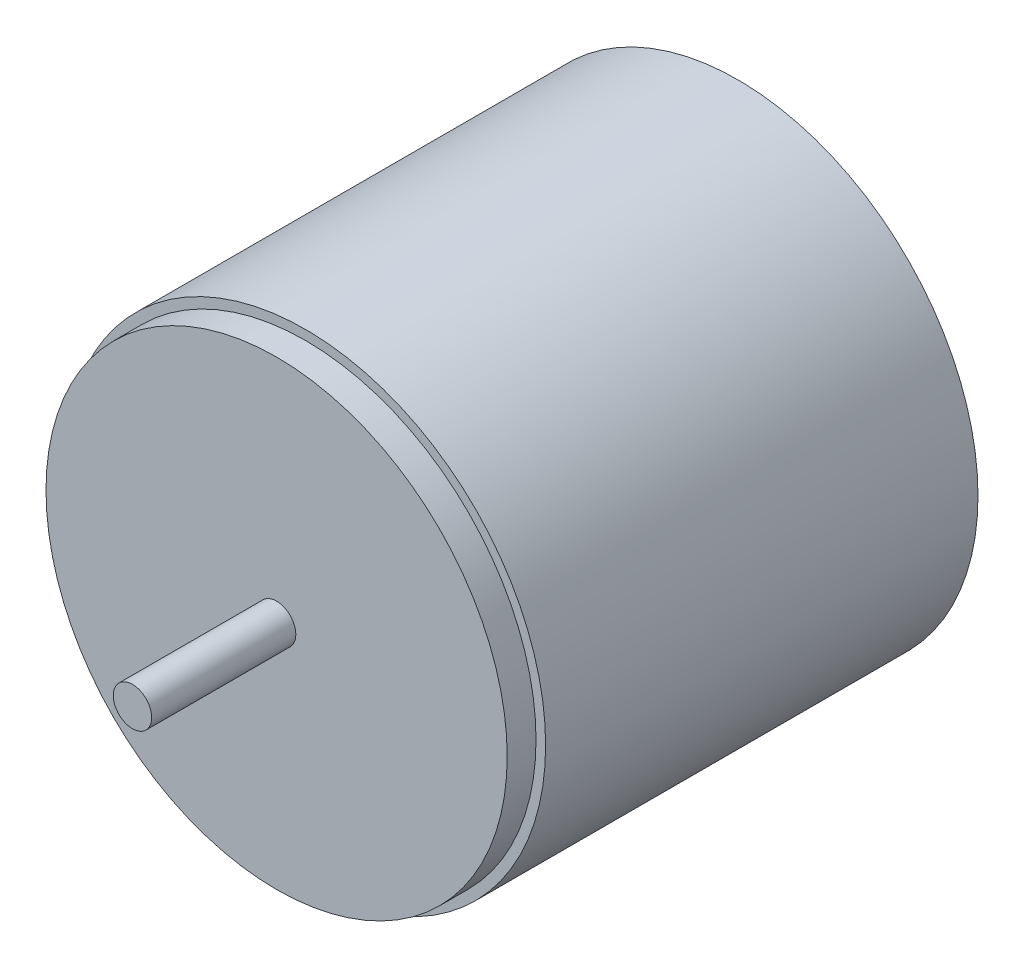
ISO-10303-21;
HEADER;
FILE_DESCRIPTION(('STEP AP214'),'2;1');
FILE_NAME('part.step','',(''),(''),'','','');
FILE_SCHEMA(('AUTOMOTIVE_DESIGN { 1 0 10303 214 1 1 1 1 }'));
ENDSEC;
DATA;
#1=APPLICATION_CONTEXT('core data for automotive mechanical design processes');
#2=APPLICATION_PROTOCOL_DEFINITION('international standard','automotive_design',2000,#1);
#3=PRODUCT_CONTEXT('',#1,'mechanical');
#4=PRODUCT('Part','Part','',(#3));
#5=PRODUCT_RELATED_PRODUCT_CATEGORY('part','',(#4));
#6=PRODUCT_DEFINITION_FORMATION('','',#4);
#7=PRODUCT_DEFINITION_CONTEXT('part definition',#1,'design');
#8=PRODUCT_DEFINITION('design','',#6,#7);
#9=PRODUCT_DEFINITION_SHAPE('','',#8);
#10=(LENGTH_UNIT() NAMED_UNIT(*) SI_UNIT(.MILLI.,.METRE.));
#11=(NAMED_UNIT(*) PLANE_ANGLE_UNIT() SI_UNIT($,.RADIAN.));
#12=(NAMED_UNIT(*) SI_UNIT($,.STERADIAN.) SOLID_ANGLE_UNIT());
#13=UNCERTAINTY_MEASURE_WITH_UNIT(LENGTH_MEASURE(1.E-05),#10,'distance_accuracy_value','');
#14=(GEOMETRIC_REPRESENTATION_CONTEXT(3) GLOBAL_UNCERTAINTY_ASSIGNED_CONTEXT((#13)) GLOBAL_UNIT_ASSIGNED_CONTEXT((#10,
#11,#12)) REPRESENTATION_CONTEXT('',''));
#15=CARTESIAN_POINT('',(0.,0.,0.));
#16=DIRECTION('',(0.,0.,1.));
#17=DIRECTION('',(1.,0.,0.));
#18=AXIS2_PLACEMENT_3D('',#15,#16,#17);
#19=CARTESIAN_POINT('',(0.,0.,45.));
#20=DIRECTION('',(0.,0.,-1.));
#21=DIRECTION('',(-1.,0.,0.));
#22=AXIS2_PLACEMENT_3D('',#19,#20,#21);
#23=CYLINDRICAL_SURFACE('',#22,25.);
#24=CARTESIAN_POINT('',(0.,0.,45.));
#25=DIRECTION('',(0.,0.,1.));
#26=DIRECTION('',(1.,0.,0.));
#27=AXIS2_PLACEMENT_3D('',#24,#25,#26);
#28=CIRCLE('',#27,25.);
#29=CARTESIAN_POINT('',(25.,0.,45.));
#30=VERTEX_POINT('',#29);
#31=EDGE_CURVE('E10',#30,#30,#28,.T.);
#32=ORIENTED_EDGE('',*,*,#31,.F.);
#33=EDGE_LOOP('',(#32));
#34=FACE_BOUND('',#33,.T.);
#35=CARTESIAN_POINT('',(0.,0.,0.));
#36=DIRECTION('',(0.,0.,1.));
#37=DIRECTION('',(1.,0.,0.));
#38=AXIS2_PLACEMENT_3D('',#35,#36,#37);
#39=CIRCLE('',#38,25.);
#40=CARTESIAN_POINT('',(25.,0.,0.));
#41=VERTEX_POINT('',#40);
#42=EDGE_CURVE('E47',#41,#41,#39,.T.);
#43=ORIENTED_EDGE('',*,*,#42,.T.);
#44=EDGE_LOOP('',(#43));
#45=FACE_BOUND('',#44,.T.);
#46=ADVANCED_FACE('F39',(#34,#45),#23,.T.);
#47=CARTESIAN_POINT('',(0.,0.,45.));
#48=DIRECTION('',(0.,0.,1.));
#49=DIRECTION('',(1.,0.,0.));
#50=AXIS2_PLACEMENT_3D('',#47,#48,#49);
#51=PLANE('',#50);
#52=CARTESIAN_POINT('',(0.,0.,45.));
#53=DIRECTION('',(0.,0.,1.));
#54=DIRECTION('',(1.,0.,0.));
#55=AXIS2_PLACEMENT_3D('',#52,#53,#54);
#56=CIRCLE('',#55,24.);
#57=CARTESIAN_POINT('',(24.,0.,45.));
#58=VERTEX_POINT('',#57);
#59=EDGE_CURVE('E53',#58,#58,#56,.F.);
#60=ORIENTED_EDGE('',*,*,#59,.T.);
#61=EDGE_LOOP('',(#60));
#62=FACE_BOUND('',#61,.T.);
#63=ORIENTED_EDGE('',*,*,#31,.T.);
#64=EDGE_LOOP('',(#63));
#65=FACE_BOUND('',#64,.T.);
#66=ADVANCED_FACE('F87',(#62,#65),#51,.T.);
#67=CARTESIAN_POINT('',(0.,0.,0.));
#68=DIRECTION('',(0.,0.,1.));
#69=DIRECTION('',(1.,0.,0.));
#70=AXIS2_PLACEMENT_3D('',#67,#68,#69);
#71=PLANE('',#70);
#72=ORIENTED_EDGE('',*,*,#42,.F.);
#73=EDGE_LOOP('',(#72));
#74=FACE_BOUND('',#73,.T.);
#75=ADVANCED_FACE('F92',(#74),#71,.F.);
#76=CARTESIAN_POINT('',(0.,0.,48.));
#77=DIRECTION('',(0.,0.,-1.));
#78=DIRECTION('',(-1.,0.,0.));
#79=AXIS2_PLACEMENT_3D('',#76,#77,#78);
#80=CYLINDRICAL_SURFACE('',#79,24.);
#81=ORIENTED_EDGE('',*,*,#59,.F.);
#82=EDGE_LOOP('',(#81));
#83=FACE_BOUND('',#82,.T.);
#84=CARTESIAN_POINT('',(0.,0.,48.));
#85=DIRECTION('',(0.,0.,1.));
#86=DIRECTION('',(1.,0.,0.));
#87=AXIS2_PLACEMENT_3D('',#84,#85,#86);
#88=CIRCLE('',#87,24.);
#89=CARTESIAN_POINT('',(24.,0.,48.));
#90=VERTEX_POINT('',#89);
#91=EDGE_CURVE('E58',#90,#90,#88,.T.);
#92=ORIENTED_EDGE('',*,*,#91,.F.);
#93=EDGE_LOOP('',(#92));
#94=FACE_BOUND('',#93,.T.);
#95=ADVANCED_FACE('F84',(#83,#94),#80,.T.);
#96=CARTESIAN_POINT('',(0.,0.,48.));
#97=DIRECTION('',(0.,0.,1.));
#98=DIRECTION('',(1.,0.,0.));
#99=AXIS2_PLACEMENT_3D('',#96,#97,#98);
#100=PLANE('',#99);
#101=CARTESIAN_POINT('',(0.,0.,48.));
#102=DIRECTION('',(0.,0.,1.));
#103=DIRECTION('',(1.,0.,0.));
#104=AXIS2_PLACEMENT_3D('',#101,#102,#103);
#105=CIRCLE('',#104,2.);
#106=CARTESIAN_POINT('',(2.,0.,48.));
#107=VERTEX_POINT('',#106);
#108=EDGE_CURVE('E42',#107,#107,#105,.F.);
#109=ORIENTED_EDGE('',*,*,#108,.T.);
#110=EDGE_LOOP('',(#109));
#111=FACE_BOUND('',#110,.T.);
#112=ORIENTED_EDGE('',*,*,#91,.T.);
#113=EDGE_LOOP('',(#112));
#114=FACE_BOUND('',#113,.T.);
#115=ADVANCED_FACE('F71',(#111,#114),#100,.T.);
#116=CARTESIAN_POINT('',(0.,0.,63.));
#117=DIRECTION('',(0.,0.,-1.));
#118=DIRECTION('',(-1.,0.,0.));
#119=AXIS2_PLACEMENT_3D('',#116,#117,#118);
#120=CYLINDRICAL_SURFACE('',#119,2.);
#121=ORIENTED_EDGE('',*,*,#108,.F.);
#122=EDGE_LOOP('',(#121));
#123=FACE_BOUND('',#122,.T.);
#124=CARTESIAN_POINT('',(0.,0.,63.));
#125=DIRECTION('',(0.,0.,1.));
#126=DIRECTION('',(1.,0.,0.));
#127=AXIS2_PLACEMENT_3D('',#124,#125,#126);
#128=CIRCLE('',#127,2.);
#129=CARTESIAN_POINT('',(2.,0.,63.));
#130=VERTEX_POINT('',#129);
#131=EDGE_CURVE('E62',#130,#130,#128,.T.);
#132=ORIENTED_EDGE('',*,*,#131,.F.);
#133=EDGE_LOOP('',(#132));
#134=FACE_BOUND('',#133,.T.);
#135=ADVANCED_FACE('F74',(#123,#134),#120,.T.);
#136=CARTESIAN_POINT('',(0.,0.,63.));
#137=DIRECTION('',(0.,0.,1.));
#138=DIRECTION('',(1.,0.,0.));
#139=AXIS2_PLACEMENT_3D('',#136,#137,#138);
#140=PLANE('',#139);
#141=ORIENTED_EDGE('',*,*,#131,.T.);
#142=EDGE_LOOP('',(#141));
#143=FACE_BOUND('',#142,.T.);
#144=ADVANCED_FACE('F77',(#143),#140,.T.);
#145=CLOSED_SHELL('',(#46,#66,#75,#95,#115,#135,#144));
#146=MANIFOLD_SOLID_BREP('B2',#145);
#147=ADVANCED_BREP_SHAPE_REPRESENTATION('',(#18,#146),#14);
#148=SHAPE_DEFINITION_REPRESENTATION(#9,#147);
ENDSEC;
END-ISO-10303-21;
